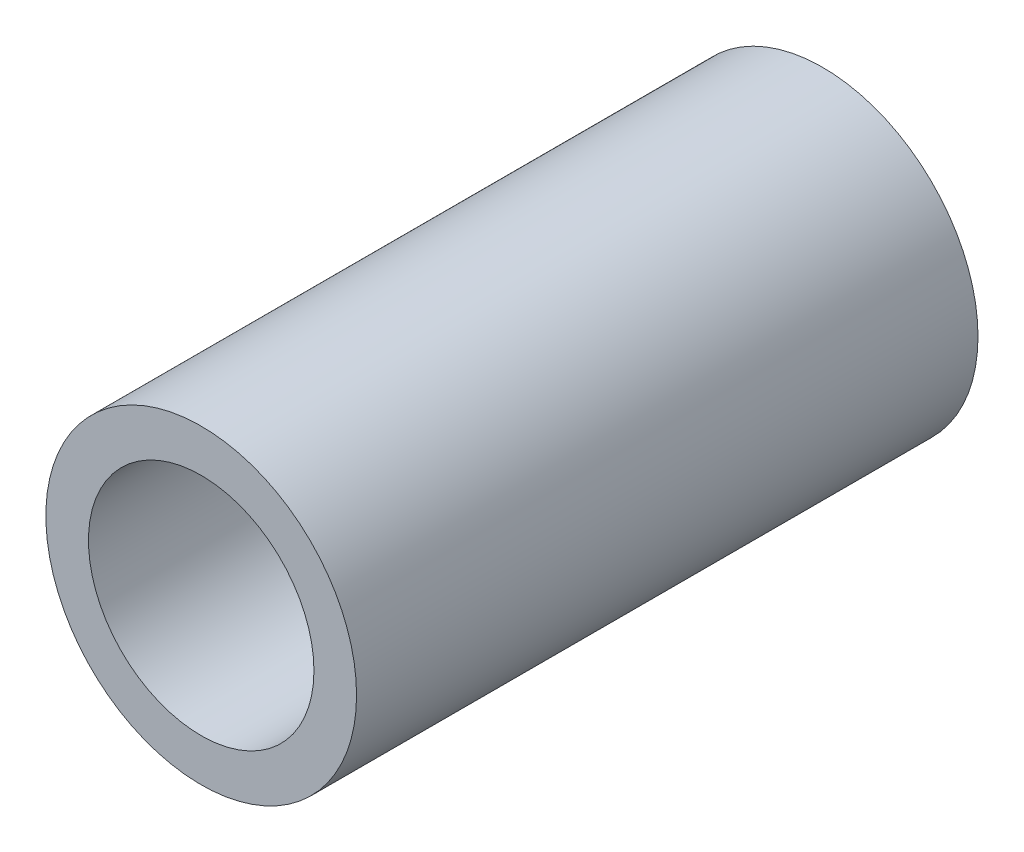
ISO-10303-21;
HEADER;
FILE_DESCRIPTION(('STEP AP214'),'2;1');
FILE_NAME('part.step','',(''),(''),'','','');
FILE_SCHEMA(('AUTOMOTIVE_DESIGN { 1 0 10303 214 1 1 1 1 }'));
ENDSEC;
DATA;
#1=APPLICATION_CONTEXT('core data for automotive mechanical design processes');
#2=APPLICATION_PROTOCOL_DEFINITION('international standard','automotive_design',2000,#1);
#3=PRODUCT_CONTEXT('',#1,'mechanical');
#4=PRODUCT('Part','Part','',(#3));
#5=PRODUCT_RELATED_PRODUCT_CATEGORY('part','',(#4));
#6=PRODUCT_DEFINITION_FORMATION('','',#4);
#7=PRODUCT_DEFINITION_CONTEXT('part definition',#1,'design');
#8=PRODUCT_DEFINITION('design','',#6,#7);
#9=PRODUCT_DEFINITION_SHAPE('','',#8);
#10=(LENGTH_UNIT() NAMED_UNIT(*) SI_UNIT(.MILLI.,.METRE.));
#11=(NAMED_UNIT(*) PLANE_ANGLE_UNIT() SI_UNIT($,.RADIAN.));
#12=(NAMED_UNIT(*) SI_UNIT($,.STERADIAN.) SOLID_ANGLE_UNIT());
#13=UNCERTAINTY_MEASURE_WITH_UNIT(LENGTH_MEASURE(1.E-05),#10,'distance_accuracy_value','');
#14=(GEOMETRIC_REPRESENTATION_CONTEXT(3) GLOBAL_UNCERTAINTY_ASSIGNED_CONTEXT((#13)) GLOBAL_UNIT_ASSIGNED_CONTEXT((#10,
#11,#12)) REPRESENTATION_CONTEXT('',''));
#15=CARTESIAN_POINT('',(0.,0.,0.));
#16=DIRECTION('',(0.,0.,1.));
#17=DIRECTION('',(1.,0.,0.));
#18=AXIS2_PLACEMENT_3D('',#15,#16,#17);
#19=CARTESIAN_POINT('',(0.,0.,22.225));
#20=DIRECTION('',(0.,0.,1.));
#21=DIRECTION('',(1.,0.,0.));
#22=AXIS2_PLACEMENT_3D('',#19,#20,#21);
#23=PLANE('',#22);
#24=CARTESIAN_POINT('',(0.,0.,22.225));
#25=DIRECTION('',(0.,0.,1.));
#26=DIRECTION('',(1.,0.,0.));
#27=AXIS2_PLACEMENT_3D('',#24,#25,#26);
#28=CIRCLE('',#27,11.1125);
#29=CARTESIAN_POINT('',(11.1125,0.,22.225));
#30=VERTEX_POINT('',#29);
#31=EDGE_CURVE('E10',#30,#30,#28,.T.);
#32=ORIENTED_EDGE('',*,*,#31,.T.);
#33=EDGE_LOOP('',(#32));
#34=FACE_BOUND('',#33,.T.);
#35=CARTESIAN_POINT('',(0.,0.,22.225));
#36=DIRECTION('',(0.,0.,1.));
#37=DIRECTION('',(1.,0.,0.));
#38=AXIS2_PLACEMENT_3D('',#35,#36,#37);
#39=CIRCLE('',#38,8.0645);
#40=CARTESIAN_POINT('',(8.0645,0.,22.225));
#41=VERTEX_POINT('',#40);
#42=EDGE_CURVE('E43',#41,#41,#39,.T.);
#43=ORIENTED_EDGE('',*,*,#42,.F.);
#44=EDGE_LOOP('',(#43));
#45=FACE_BOUND('',#44,.T.);
#46=ADVANCED_FACE('F32',(#34,#45),#23,.T.);
#47=CARTESIAN_POINT('',(0.,0.,-22.225));
#48=DIRECTION('',(0.,0.,1.));
#49=DIRECTION('',(1.,0.,0.));
#50=AXIS2_PLACEMENT_3D('',#47,#48,#49);
#51=PLANE('',#50);
#52=CARTESIAN_POINT('',(0.,0.,-22.225));
#53=DIRECTION('',(0.,0.,1.));
#54=DIRECTION('',(1.,0.,0.));
#55=AXIS2_PLACEMENT_3D('',#52,#53,#54);
#56=CIRCLE('',#55,11.1125);
#57=CARTESIAN_POINT('',(11.1125,0.,-22.225));
#58=VERTEX_POINT('',#57);
#59=EDGE_CURVE('E36',#58,#58,#56,.T.);
#60=ORIENTED_EDGE('',*,*,#59,.F.);
#61=EDGE_LOOP('',(#60));
#62=FACE_BOUND('',#61,.T.);
#63=CARTESIAN_POINT('',(0.,0.,-22.225));
#64=DIRECTION('',(0.,0.,1.));
#65=DIRECTION('',(1.,0.,0.));
#66=AXIS2_PLACEMENT_3D('',#63,#64,#65);
#67=CIRCLE('',#66,8.0645);
#68=CARTESIAN_POINT('',(8.0645,0.,-22.225));
#69=VERTEX_POINT('',#68);
#70=EDGE_CURVE('E45',#69,#69,#67,.T.);
#71=ORIENTED_EDGE('',*,*,#70,.T.);
#72=EDGE_LOOP('',(#71));
#73=FACE_BOUND('',#72,.T.);
#74=ADVANCED_FACE('F55',(#62,#73),#51,.F.);
#75=CARTESIAN_POINT('',(0.,0.,22.225));
#76=DIRECTION('',(0.,0.,-1.));
#77=DIRECTION('',(-1.,0.,0.));
#78=AXIS2_PLACEMENT_3D('',#75,#76,#77);
#79=CYLINDRICAL_SURFACE('',#78,11.1125);
#80=ORIENTED_EDGE('',*,*,#31,.F.);
#81=EDGE_LOOP('',(#80));
#82=FACE_BOUND('',#81,.T.);
#83=ORIENTED_EDGE('',*,*,#59,.T.);
#84=EDGE_LOOP('',(#83));
#85=FACE_BOUND('',#84,.T.);
#86=ADVANCED_FACE('F34',(#82,#85),#79,.T.);
#87=CARTESIAN_POINT('',(0.,0.,22.225));
#88=DIRECTION('',(0.,0.,-1.));
#89=DIRECTION('',(-1.,0.,0.));
#90=AXIS2_PLACEMENT_3D('',#87,#88,#89);
#91=CYLINDRICAL_SURFACE('',#90,8.0645);
#92=ORIENTED_EDGE('',*,*,#42,.T.);
#93=EDGE_LOOP('',(#92));
#94=FACE_BOUND('',#93,.T.);
#95=ORIENTED_EDGE('',*,*,#70,.F.);
#96=EDGE_LOOP('',(#95));
#97=FACE_BOUND('',#96,.T.);
#98=ADVANCED_FACE('F51',(#94,#97),#91,.F.);
#99=CLOSED_SHELL('',(#46,#74,#86,#98));
#100=MANIFOLD_SOLID_BREP('B2',#99);
#101=ADVANCED_BREP_SHAPE_REPRESENTATION('',(#18,#100),#14);
#102=SHAPE_DEFINITION_REPRESENTATION(#9,#101);
ENDSEC;
END-ISO-10303-21;
